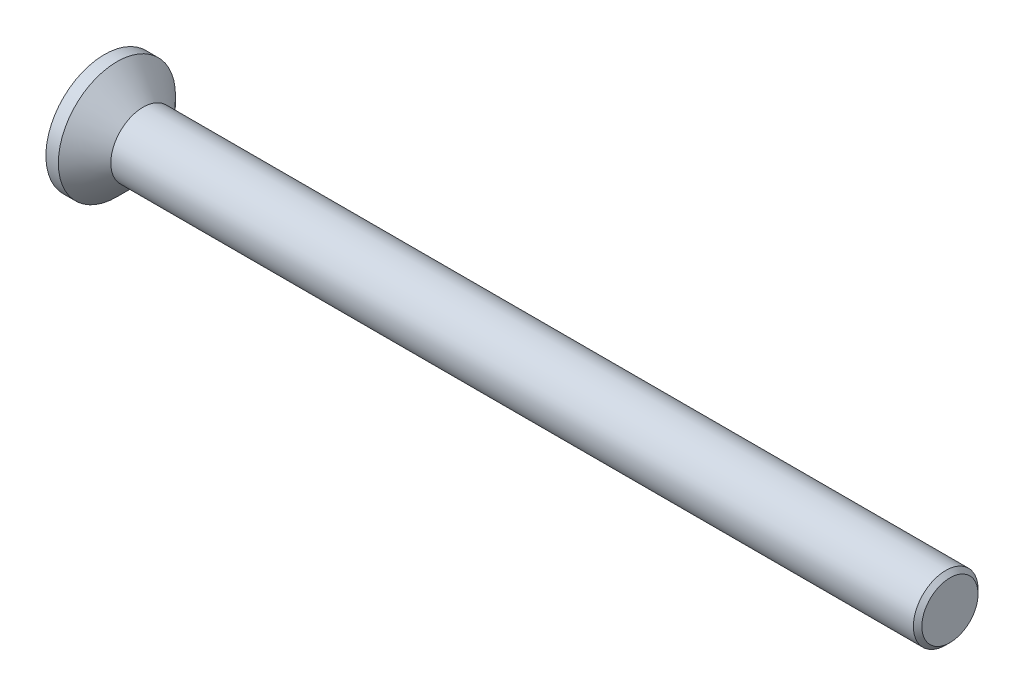
ISO-10303-21;
HEADER;
FILE_DESCRIPTION(('STEP AP214'),'2;1');
FILE_NAME('part.step','',(''),(''),'','','');
FILE_SCHEMA(('AUTOMOTIVE_DESIGN { 1 0 10303 214 1 1 1 1 }'));
ENDSEC;
DATA;
#1=APPLICATION_CONTEXT('core data for automotive mechanical design processes');
#2=APPLICATION_PROTOCOL_DEFINITION('international standard','automotive_design',2000,#1);
#3=PRODUCT_CONTEXT('',#1,'mechanical');
#4=PRODUCT('Part','Part','',(#3));
#5=PRODUCT_RELATED_PRODUCT_CATEGORY('part','',(#4));
#6=PRODUCT_DEFINITION_FORMATION('','',#4);
#7=PRODUCT_DEFINITION_CONTEXT('part definition',#1,'design');
#8=PRODUCT_DEFINITION('design','',#6,#7);
#9=PRODUCT_DEFINITION_SHAPE('','',#8);
#10=(LENGTH_UNIT() NAMED_UNIT(*) SI_UNIT(.MILLI.,.METRE.));
#11=(NAMED_UNIT(*) PLANE_ANGLE_UNIT() SI_UNIT($,.RADIAN.));
#12=(NAMED_UNIT(*) SI_UNIT($,.STERADIAN.) SOLID_ANGLE_UNIT());
#13=UNCERTAINTY_MEASURE_WITH_UNIT(LENGTH_MEASURE(1.E-05),#10,'distance_accuracy_value','');
#14=(GEOMETRIC_REPRESENTATION_CONTEXT(3) GLOBAL_UNCERTAINTY_ASSIGNED_CONTEXT((#13)) GLOBAL_UNIT_ASSIGNED_CONTEXT((#10,
#11,#12)) REPRESENTATION_CONTEXT('',''));
#15=CARTESIAN_POINT('',(0.,0.,0.));
#16=DIRECTION('',(0.,0.,1.));
#17=DIRECTION('',(1.,0.,0.));
#18=AXIS2_PLACEMENT_3D('',#15,#16,#17);
#19=CARTESIAN_POINT('',(1.09999999999999,0.,0.));
#20=DIRECTION('',(-1.,0.,0.));
#21=DIRECTION('',(0.,0.,1.));
#22=AXIS2_PLACEMENT_3D('',#19,#20,#21);
#23=CONICAL_SURFACE('',#22,0.99999999999989,1.04719755119658);
#24=CARTESIAN_POINT('',(1.67735026918958,0.,0.));
#25=VERTEX_POINT('',#24);
#26=VERTEX_LOOP('',#25);
#27=FACE_BOUND('',#26,.T.);
#28=CARTESIAN_POINT('',(1.09999999999999,0.,0.));
#29=DIRECTION('',(-1.,0.,0.));
#30=DIRECTION('',(0.,0.,1.));
#31=AXIS2_PLACEMENT_3D('',#28,#29,#30);
#32=CIRCLE('',#31,0.99999999999989);
#33=CARTESIAN_POINT('',(1.09999999999999,-0.499999999999972,0.86602540378439));
#34=VERTEX_POINT('',#33);
#35=CARTESIAN_POINT('',(1.09999999999999,0.499999999999972,0.866025403784391));
#36=VERTEX_POINT('',#35);
#37=EDGE_CURVE('E92',#34,#36,#32,.T.);
#38=ORIENTED_EDGE('',*,*,#37,.T.);
#39=CARTESIAN_POINT('',(1.09999999999999,0.,0.));
#40=DIRECTION('',(-1.,0.,0.));
#41=DIRECTION('',(0.,0.,1.));
#42=AXIS2_PLACEMENT_3D('',#39,#40,#41);
#43=CIRCLE('',#42,0.99999999999989);
#44=CARTESIAN_POINT('',(1.09999999999999,0.999999999999945,0.));
#45=VERTEX_POINT('',#44);
#46=EDGE_CURVE('E106',#36,#45,#43,.T.);
#47=ORIENTED_EDGE('',*,*,#46,.T.);
#48=CARTESIAN_POINT('',(1.09999999999999,0.,0.));
#49=DIRECTION('',(-1.,0.,0.));
#50=DIRECTION('',(0.,0.,1.));
#51=AXIS2_PLACEMENT_3D('',#48,#49,#50);
#52=CIRCLE('',#51,0.99999999999989);
#53=CARTESIAN_POINT('',(1.09999999999999,0.499999999999972,-0.866025403784391));
#54=VERTEX_POINT('',#53);
#55=EDGE_CURVE('E149',#45,#54,#52,.T.);
#56=ORIENTED_EDGE('',*,*,#55,.T.);
#57=CARTESIAN_POINT('',(1.09999999999999,0.,0.));
#58=DIRECTION('',(-1.,0.,0.));
#59=DIRECTION('',(0.,0.,1.));
#60=AXIS2_PLACEMENT_3D('',#57,#58,#59);
#61=CIRCLE('',#60,0.99999999999989);
#62=CARTESIAN_POINT('',(1.09999999999999,-0.499999999999973,-0.866025403784392));
#63=VERTEX_POINT('',#62);
#64=EDGE_CURVE('E136',#54,#63,#61,.T.);
#65=ORIENTED_EDGE('',*,*,#64,.T.);
#66=CARTESIAN_POINT('',(1.09999999999999,0.,0.));
#67=DIRECTION('',(-1.,0.,0.));
#68=DIRECTION('',(0.,0.,1.));
#69=AXIS2_PLACEMENT_3D('',#66,#67,#68);
#70=CIRCLE('',#69,0.99999999999989);
#71=CARTESIAN_POINT('',(1.09999999999999,-0.999999999999945,0.));
#72=VERTEX_POINT('',#71);
#73=EDGE_CURVE('E89',#63,#72,#70,.T.);
#74=ORIENTED_EDGE('',*,*,#73,.T.);
#75=CARTESIAN_POINT('',(1.09999999999999,0.,0.));
#76=DIRECTION('',(-1.,0.,0.));
#77=DIRECTION('',(0.,0.,1.));
#78=AXIS2_PLACEMENT_3D('',#75,#76,#77);
#79=CIRCLE('',#78,0.99999999999989);
#80=EDGE_CURVE('E20',#72,#34,#79,.T.);
#81=ORIENTED_EDGE('',*,*,#80,.T.);
#82=EDGE_LOOP('',(#38,#47,#56,#65,#74,#81));
#83=FACE_BOUND('',#82,.T.);
#84=ADVANCED_FACE('F17',(#27,#83),#23,.F.);
#85=CARTESIAN_POINT('',(1.1,0.,-1.15470053837925));
#86=DIRECTION('',(1.,0.,0.));
#87=DIRECTION('',(0.,0.,-1.));
#88=AXIS2_PLACEMENT_3D('',#85,#86,#87);
#89=PLANE('',#88);
#90=DIRECTION('',(0.,0.,1.));
#91=VECTOR('',#90,1.);
#92=CARTESIAN_POINT('',(1.1,-1.,0.577350269189625));
#93=LINE('',#92,#91);
#94=CARTESIAN_POINT('',(1.1,-1.,0.577350269189624));
#95=VERTEX_POINT('',#94);
#96=EDGE_CURVE('E111',#95,#72,#93,.F.);
#97=ORIENTED_EDGE('',*,*,#96,.F.);
#98=DIRECTION('',(0.,0.866025403784439,0.5));
#99=VECTOR('',#98,1.);
#100=CARTESIAN_POINT('',(1.1,0.,1.15470053837925));
#101=LINE('',#100,#99);
#102=EDGE_CURVE('E108',#34,#95,#101,.F.);
#103=ORIENTED_EDGE('',*,*,#102,.F.);
#104=ORIENTED_EDGE('',*,*,#80,.F.);
#105=EDGE_LOOP('',(#97,#103,#104));
#106=FACE_BOUND('',#105,.T.);
#107=ADVANCED_FACE('F109',(#106),#89,.F.);
#108=CARTESIAN_POINT('',(1.1,0.,-1.15470053837925));
#109=DIRECTION('',(1.,0.,0.));
#110=DIRECTION('',(0.,0.,-1.));
#111=AXIS2_PLACEMENT_3D('',#108,#109,#110);
#112=PLANE('',#111);
#113=DIRECTION('',(0.,0.866025403784439,0.5));
#114=VECTOR('',#113,1.);
#115=CARTESIAN_POINT('',(1.1,0.,1.15470053837925));
#116=LINE('',#115,#114);
#117=CARTESIAN_POINT('',(1.1,0.,1.15470053837925));
#118=VERTEX_POINT('',#117);
#119=EDGE_CURVE('E101',#118,#34,#116,.F.);
#120=ORIENTED_EDGE('',*,*,#119,.F.);
#121=DIRECTION('',(0.,0.866025403784439,-0.5));
#122=VECTOR('',#121,1.);
#123=CARTESIAN_POINT('',(1.1,1.,0.577350269189625));
#124=LINE('',#123,#122);
#125=EDGE_CURVE('E104',#36,#118,#124,.F.);
#126=ORIENTED_EDGE('',*,*,#125,.F.);
#127=ORIENTED_EDGE('',*,*,#37,.F.);
#128=EDGE_LOOP('',(#120,#126,#127));
#129=FACE_BOUND('',#128,.T.);
#130=ADVANCED_FACE('F99',(#129),#112,.F.);
#131=CARTESIAN_POINT('',(1.1,0.,-1.15470053837925));
#132=DIRECTION('',(1.,0.,0.));
#133=DIRECTION('',(0.,0.,-1.));
#134=AXIS2_PLACEMENT_3D('',#131,#132,#133);
#135=PLANE('',#134);
#136=DIRECTION('',(0.,0.866025403784439,-0.5));
#137=VECTOR('',#136,1.);
#138=CARTESIAN_POINT('',(1.1,1.,0.577350269189625));
#139=LINE('',#138,#137);
#140=CARTESIAN_POINT('',(1.1,1.,0.577350269189625));
#141=VERTEX_POINT('',#140);
#142=EDGE_CURVE('E132',#141,#36,#139,.F.);
#143=ORIENTED_EDGE('',*,*,#142,.F.);
#144=DIRECTION('',(0.,0.,-1.));
#145=VECTOR('',#144,1.);
#146=CARTESIAN_POINT('',(1.1,1.,-0.577350269189625));
#147=LINE('',#146,#145);
#148=EDGE_CURVE('E165',#45,#141,#147,.F.);
#149=ORIENTED_EDGE('',*,*,#148,.F.);
#150=ORIENTED_EDGE('',*,*,#46,.F.);
#151=EDGE_LOOP('',(#143,#149,#150));
#152=FACE_BOUND('',#151,.T.);
#153=ADVANCED_FACE('F166',(#152),#135,.F.);
#154=CARTESIAN_POINT('',(1.1,0.,-1.15470053837925));
#155=DIRECTION('',(1.,0.,0.));
#156=DIRECTION('',(0.,0.,-1.));
#157=AXIS2_PLACEMENT_3D('',#154,#155,#156);
#158=PLANE('',#157);
#159=DIRECTION('',(0.,0.,-1.));
#160=VECTOR('',#159,1.);
#161=CARTESIAN_POINT('',(1.1,1.,-0.577350269189625));
#162=LINE('',#161,#160);
#163=CARTESIAN_POINT('',(1.1,1.,-0.577350269189625));
#164=VERTEX_POINT('',#163);
#165=EDGE_CURVE('E159',#164,#45,#162,.F.);
#166=ORIENTED_EDGE('',*,*,#165,.F.);
#167=DIRECTION('',(0.,-0.866025403784439,-0.5));
#168=VECTOR('',#167,1.);
#169=CARTESIAN_POINT('',(1.1,0.,-1.15470053837925));
#170=LINE('',#169,#168);
#171=EDGE_CURVE('E162',#54,#164,#170,.F.);
#172=ORIENTED_EDGE('',*,*,#171,.F.);
#173=ORIENTED_EDGE('',*,*,#55,.F.);
#174=EDGE_LOOP('',(#166,#172,#173));
#175=FACE_BOUND('',#174,.T.);
#176=ADVANCED_FACE('F157',(#175),#158,.F.);
#177=CARTESIAN_POINT('',(1.1,0.,-1.15470053837925));
#178=DIRECTION('',(1.,0.,0.));
#179=DIRECTION('',(0.,0.,-1.));
#180=AXIS2_PLACEMENT_3D('',#177,#178,#179);
#181=PLANE('',#180);
#182=DIRECTION('',(0.,-0.866025403784439,0.5));
#183=VECTOR('',#182,1.);
#184=CARTESIAN_POINT('',(1.1,-1.,-0.577350269189628));
#185=LINE('',#184,#183);
#186=CARTESIAN_POINT('',(1.1,-1.,-0.577350269189628));
#187=VERTEX_POINT('',#186);
#188=EDGE_CURVE('E211',#187,#63,#185,.F.);
#189=ORIENTED_EDGE('',*,*,#188,.F.);
#190=DIRECTION('',(0.,0.,1.));
#191=VECTOR('',#190,1.);
#192=CARTESIAN_POINT('',(1.1,-1.,0.577350269189625));
#193=LINE('',#192,#191);
#194=EDGE_CURVE('E120',#72,#187,#193,.F.);
#195=ORIENTED_EDGE('',*,*,#194,.F.);
#196=ORIENTED_EDGE('',*,*,#73,.F.);
#197=EDGE_LOOP('',(#189,#195,#196));
#198=FACE_BOUND('',#197,.T.);
#199=ADVANCED_FACE('F250',(#198),#181,.F.);
#200=CARTESIAN_POINT('',(1.1,0.,-1.15470053837925));
#201=DIRECTION('',(1.,0.,0.));
#202=DIRECTION('',(0.,0.,-1.));
#203=AXIS2_PLACEMENT_3D('',#200,#201,#202);
#204=PLANE('',#203);
#205=DIRECTION('',(0.,-0.866025403784439,-0.5));
#206=VECTOR('',#205,1.);
#207=CARTESIAN_POINT('',(1.1,0.,-1.15470053837925));
#208=LINE('',#207,#206);
#209=CARTESIAN_POINT('',(1.1,0.,-1.15470053837925));
#210=VERTEX_POINT('',#209);
#211=EDGE_CURVE('E184',#210,#54,#208,.F.);
#212=ORIENTED_EDGE('',*,*,#211,.F.);
#213=DIRECTION('',(0.,-0.866025403784439,0.5));
#214=VECTOR('',#213,1.);
#215=CARTESIAN_POINT('',(1.1,-1.,-0.577350269189628));
#216=LINE('',#215,#214);
#217=EDGE_CURVE('E214',#63,#210,#216,.F.);
#218=ORIENTED_EDGE('',*,*,#217,.F.);
#219=ORIENTED_EDGE('',*,*,#64,.F.);
#220=EDGE_LOOP('',(#212,#218,#219));
#221=FACE_BOUND('',#220,.T.);
#222=ADVANCED_FACE('F247',(#221),#204,.F.);
#223=CARTESIAN_POINT('',(1.1,-1.,0.577350269189625));
#224=DIRECTION('',(0.,1.,0.));
#225=DIRECTION('',(0.,0.,1.));
#226=AXIS2_PLACEMENT_3D('',#223,#224,#225);
#227=PLANE('',#226);
#228=ORIENTED_EDGE('',*,*,#194,.T.);
#229=DIRECTION('',(1.,0.,0.));
#230=VECTOR('',#229,1.);
#231=CARTESIAN_POINT('',(1.1,-1.,-0.577350269189628));
#232=LINE('',#231,#230);
#233=CARTESIAN_POINT('',(0.,-1.,-0.577350269189628));
#234=VERTEX_POINT('',#233);
#235=EDGE_CURVE('E215',#234,#187,#232,.T.);
#236=ORIENTED_EDGE('',*,*,#235,.F.);
#237=DIRECTION('',(0.,0.,-1.));
#238=VECTOR('',#237,1.);
#239=CARTESIAN_POINT('',(0.,-1.,0.));
#240=LINE('',#239,#238);
#241=CARTESIAN_POINT('',(0.,-1.,0.577350269189625));
#242=VERTEX_POINT('',#241);
#243=EDGE_CURVE('E210',#234,#242,#240,.F.);
#244=ORIENTED_EDGE('',*,*,#243,.T.);
#245=DIRECTION('',(1.,0.,0.));
#246=VECTOR('',#245,1.);
#247=CARTESIAN_POINT('',(1.1,-1.,0.577350269189624));
#248=LINE('',#247,#246);
#249=EDGE_CURVE('E115',#95,#242,#248,.F.);
#250=ORIENTED_EDGE('',*,*,#249,.F.);
#251=ORIENTED_EDGE('',*,*,#96,.T.);
#252=EDGE_LOOP('',(#228,#236,#244,#250,#251));
#253=FACE_BOUND('',#252,.T.);
#254=ADVANCED_FACE('F252',(#253),#227,.T.);
#255=CARTESIAN_POINT('',(1.1,0.,1.15470053837925));
#256=DIRECTION('',(0.,0.5,-0.866025403784439));
#257=DIRECTION('',(0.,0.866025403784439,0.5));
#258=AXIS2_PLACEMENT_3D('',#255,#256,#257);
#259=PLANE('',#258);
#260=ORIENTED_EDGE('',*,*,#102,.T.);
#261=ORIENTED_EDGE('',*,*,#249,.T.);
#262=DIRECTION('',(0.,0.866025403784439,0.499999999999999));
#263=VECTOR('',#262,1.);
#264=CARTESIAN_POINT('',(0.,-1.,0.577350269189625));
#265=LINE('',#264,#263);
#266=CARTESIAN_POINT('',(0.,0.,1.15470053837925));
#267=VERTEX_POINT('',#266);
#268=EDGE_CURVE('E205',#242,#267,#265,.T.);
#269=ORIENTED_EDGE('',*,*,#268,.T.);
#270=DIRECTION('',(1.,0.,0.));
#271=VECTOR('',#270,1.);
#272=CARTESIAN_POINT('',(1.1,0.,1.15470053837925));
#273=LINE('',#272,#271);
#274=EDGE_CURVE('E119',#118,#267,#273,.F.);
#275=ORIENTED_EDGE('',*,*,#274,.F.);
#276=ORIENTED_EDGE('',*,*,#119,.T.);
#277=EDGE_LOOP('',(#260,#261,#269,#275,#276));
#278=FACE_BOUND('',#277,.T.);
#279=ADVANCED_FACE('F117',(#278),#259,.T.);
#280=CARTESIAN_POINT('',(1.1,1.,0.577350269189625));
#281=DIRECTION('',(0.,-0.5,-0.866025403784439));
#282=DIRECTION('',(0.,0.866025403784439,-0.5));
#283=AXIS2_PLACEMENT_3D('',#280,#281,#282);
#284=PLANE('',#283);
#285=ORIENTED_EDGE('',*,*,#125,.T.);
#286=ORIENTED_EDGE('',*,*,#274,.T.);
#287=DIRECTION('',(0.,0.866025403784439,-0.5));
#288=VECTOR('',#287,1.);
#289=CARTESIAN_POINT('',(0.,0.,1.15470053837925));
#290=LINE('',#289,#288);
#291=CARTESIAN_POINT('',(0.,1.,0.577350269189625));
#292=VERTEX_POINT('',#291);
#293=EDGE_CURVE('E195',#267,#292,#290,.T.);
#294=ORIENTED_EDGE('',*,*,#293,.T.);
#295=DIRECTION('',(1.,0.,0.));
#296=VECTOR('',#295,1.);
#297=CARTESIAN_POINT('',(1.1,1.,0.577350269189625));
#298=LINE('',#297,#296);
#299=EDGE_CURVE('E170',#141,#292,#298,.F.);
#300=ORIENTED_EDGE('',*,*,#299,.F.);
#301=ORIENTED_EDGE('',*,*,#142,.T.);
#302=EDGE_LOOP('',(#285,#286,#294,#300,#301));
#303=FACE_BOUND('',#302,.T.);
#304=ADVANCED_FACE('F193',(#303),#284,.T.);
#305=CARTESIAN_POINT('',(1.1,1.,-0.577350269189625));
#306=DIRECTION('',(0.,-1.,0.));
#307=DIRECTION('',(0.,0.,-1.));
#308=AXIS2_PLACEMENT_3D('',#305,#306,#307);
#309=PLANE('',#308);
#310=ORIENTED_EDGE('',*,*,#148,.T.);
#311=ORIENTED_EDGE('',*,*,#299,.T.);
#312=DIRECTION('',(0.,0.,-1.));
#313=VECTOR('',#312,1.);
#314=CARTESIAN_POINT('',(0.,1.,0.));
#315=LINE('',#314,#313);
#316=CARTESIAN_POINT('',(0.,1.,-0.577350269189625));
#317=VERTEX_POINT('',#316);
#318=EDGE_CURVE('E197',#292,#317,#315,.T.);
#319=ORIENTED_EDGE('',*,*,#318,.T.);
#320=DIRECTION('',(1.,0.,0.));
#321=VECTOR('',#320,1.);
#322=CARTESIAN_POINT('',(1.1,1.,-0.577350269189626));
#323=LINE('',#322,#321);
#324=EDGE_CURVE('E173',#164,#317,#323,.F.);
#325=ORIENTED_EDGE('',*,*,#324,.F.);
#326=ORIENTED_EDGE('',*,*,#165,.T.);
#327=EDGE_LOOP('',(#310,#311,#319,#325,#326));
#328=FACE_BOUND('',#327,.T.);
#329=ADVANCED_FACE('F172',(#328),#309,.T.);
#330=CARTESIAN_POINT('',(1.1,0.,-1.15470053837925));
#331=DIRECTION('',(0.,-0.5,0.866025403784439));
#332=DIRECTION('',(0.,-0.866025403784439,-0.5));
#333=AXIS2_PLACEMENT_3D('',#330,#331,#332);
#334=PLANE('',#333);
#335=ORIENTED_EDGE('',*,*,#171,.T.);
#336=ORIENTED_EDGE('',*,*,#324,.T.);
#337=DIRECTION('',(0.,-0.866025403784438,-0.5));
#338=VECTOR('',#337,1.);
#339=CARTESIAN_POINT('',(0.,1.,-0.577350269189625));
#340=LINE('',#339,#338);
#341=CARTESIAN_POINT('',(0.,0.,-1.15470053837925));
#342=VERTEX_POINT('',#341);
#343=EDGE_CURVE('E35',#317,#342,#340,.T.);
#344=ORIENTED_EDGE('',*,*,#343,.T.);
#345=DIRECTION('',(1.,0.,0.));
#346=VECTOR('',#345,1.);
#347=CARTESIAN_POINT('',(1.1,0.,-1.15470053837925));
#348=LINE('',#347,#346);
#349=EDGE_CURVE('E220',#210,#342,#348,.F.);
#350=ORIENTED_EDGE('',*,*,#349,.F.);
#351=ORIENTED_EDGE('',*,*,#211,.T.);
#352=EDGE_LOOP('',(#335,#336,#344,#350,#351));
#353=FACE_BOUND('',#352,.T.);
#354=ADVANCED_FACE('F244',(#353),#334,.T.);
#355=CARTESIAN_POINT('',(1.1,-1.,-0.577350269189628));
#356=DIRECTION('',(0.,0.5,0.866025403784439));
#357=DIRECTION('',(0.,-0.866025403784439,0.5));
#358=AXIS2_PLACEMENT_3D('',#355,#356,#357);
#359=PLANE('',#358);
#360=ORIENTED_EDGE('',*,*,#217,.T.);
#361=ORIENTED_EDGE('',*,*,#349,.T.);
#362=DIRECTION('',(0.,-0.866025403784439,0.5));
#363=VECTOR('',#362,1.);
#364=CARTESIAN_POINT('',(0.,0.,-1.15470053837925));
#365=LINE('',#364,#363);
#366=EDGE_CURVE('E146',#342,#234,#365,.T.);
#367=ORIENTED_EDGE('',*,*,#366,.T.);
#368=ORIENTED_EDGE('',*,*,#235,.T.);
#369=ORIENTED_EDGE('',*,*,#188,.T.);
#370=EDGE_LOOP('',(#360,#361,#367,#368,#369));
#371=FACE_BOUND('',#370,.T.);
#372=ADVANCED_FACE('F255',(#371),#359,.T.);
#373=CARTESIAN_POINT('',(0.,0.,0.));
#374=DIRECTION('',(1.,0.,0.));
#375=DIRECTION('',(0.,0.,-1.));
#376=AXIS2_PLACEMENT_3D('',#373,#374,#375);
#377=PLANE('',#376);
#378=ORIENTED_EDGE('',*,*,#343,.F.);
#379=ORIENTED_EDGE('',*,*,#318,.F.);
#380=ORIENTED_EDGE('',*,*,#293,.F.);
#381=ORIENTED_EDGE('',*,*,#268,.F.);
#382=ORIENTED_EDGE('',*,*,#243,.F.);
#383=ORIENTED_EDGE('',*,*,#366,.F.);
#384=EDGE_LOOP('',(#378,#379,#380,#381,#382,#383));
#385=FACE_BOUND('',#384,.T.);
#386=CARTESIAN_POINT('',(0.,0.,0.));
#387=DIRECTION('',(1.,0.,0.));
#388=DIRECTION('',(0.,0.,-1.));
#389=AXIS2_PLACEMENT_3D('',#386,#387,#388);
#390=CIRCLE('',#389,2.77);
#391=CARTESIAN_POINT('',(0.,0.,-2.77));
#392=VERTEX_POINT('',#391);
#393=EDGE_CURVE('E143',#392,#392,#390,.T.);
#394=ORIENTED_EDGE('',*,*,#393,.F.);
#395=EDGE_LOOP('',(#394));
#396=FACE_BOUND('',#395,.T.);
#397=ADVANCED_FACE('F199',(#385,#396),#377,.F.);
#398=CARTESIAN_POINT('',(40.0007106781187,0.,0.));
#399=DIRECTION('',(-1.,0.,0.));
#400=DIRECTION('',(0.,0.,1.));
#401=AXIS2_PLACEMENT_3D('',#398,#399,#400);
#402=PLANE('',#401);
#403=CARTESIAN_POINT('',(40.0007106781004,0.,0.));
#404=DIRECTION('',(-1.,0.,0.));
#405=DIRECTION('',(0.,0.,1.));
#406=AXIS2_PLACEMENT_3D('',#403,#404,#405);
#407=CIRCLE('',#406,1.32928932180221);
#408=CARTESIAN_POINT('',(40.0007106781004,0.,1.32928932180221));
#409=VERTEX_POINT('',#408);
#410=EDGE_CURVE('E139',#409,#409,#407,.T.);
#411=ORIENTED_EDGE('',*,*,#410,.F.);
#412=EDGE_LOOP('',(#411));
#413=FACE_BOUND('',#412,.T.);
#414=ADVANCED_FACE('F263',(#413),#402,.F.);
#415=CARTESIAN_POINT('',(11.8531386861314,0.,0.));
#416=DIRECTION('',(1.,0.,0.));
#417=DIRECTION('',(0.,0.,-1.));
#418=AXIS2_PLACEMENT_3D('',#415,#416,#417);
#419=CYLINDRICAL_SURFACE('',#418,2.77);
#420=CARTESIAN_POINT('',(0.589999999988322,0.,0.));
#421=DIRECTION('',(-1.,0.,0.));
#422=DIRECTION('',(0.,0.,-1.));
#423=AXIS2_PLACEMENT_3D('',#420,#421,#422);
#424=CIRCLE('',#423,2.77000000005501);
#425=CARTESIAN_POINT('',(0.589999999988322,0.,-2.77000000005501));
#426=VERTEX_POINT('',#425);
#427=EDGE_CURVE('E142',#426,#426,#424,.F.);
#428=ORIENTED_EDGE('',*,*,#427,.F.);
#429=EDGE_LOOP('',(#428));
#430=FACE_BOUND('',#429,.T.);
#431=ORIENTED_EDGE('',*,*,#393,.T.);
#432=EDGE_LOOP('',(#431));
#433=FACE_BOUND('',#432,.T.);
#434=ADVANCED_FACE('F281',(#430,#433),#419,.T.);
#435=CARTESIAN_POINT('',(39.8007106781506,0.,0.));
#436=DIRECTION('',(-1.,0.,0.));
#437=DIRECTION('',(0.,0.,1.));
#438=AXIS2_PLACEMENT_3D('',#435,#436,#437);
#439=CONICAL_SURFACE('',#438,1.52928932180885,0.785398163539557);
#440=CARTESIAN_POINT('',(39.8007106781186,0.,0.));
#441=DIRECTION('',(-1.,0.,0.));
#442=DIRECTION('',(0.,0.,1.));
#443=AXIS2_PLACEMENT_3D('',#440,#441,#442);
#444=CIRCLE('',#443,1.52928932188135);
#445=CARTESIAN_POINT('',(39.8007106781186,0.,1.52928932188135));
#446=VERTEX_POINT('',#445);
#447=EDGE_CURVE('E26',#446,#446,#444,.T.);
#448=ORIENTED_EDGE('',*,*,#447,.F.);
#449=EDGE_LOOP('',(#448));
#450=FACE_BOUND('',#449,.T.);
#451=ORIENTED_EDGE('',*,*,#410,.T.);
#452=EDGE_LOOP('',(#451));
#453=FACE_BOUND('',#452,.T.);
#454=ADVANCED_FACE('F274',(#450,#453),#439,.T.);
#455=CARTESIAN_POINT('',(0.589999999931479,0.,0.));
#456=DIRECTION('',(-1.,0.,0.));
#457=DIRECTION('',(0.,0.,1.));
#458=AXIS2_PLACEMENT_3D('',#455,#456,#457);
#459=CONICAL_SURFACE('',#458,2.77000000011185,0.785398163397448);
#460=ORIENTED_EDGE('',*,*,#427,.T.);
#461=EDGE_LOOP('',(#460));
#462=FACE_BOUND('',#461,.T.);
#463=CARTESIAN_POINT('',(1.83071067811866,0.,0.));
#464=DIRECTION('',(-1.,0.,0.));
#465=DIRECTION('',(0.,0.,1.));
#466=AXIS2_PLACEMENT_3D('',#463,#464,#465);
#467=CIRCLE('',#466,1.52928932188135);
#468=CARTESIAN_POINT('',(1.83071067811866,0.,1.52928932188135));
#469=VERTEX_POINT('',#468);
#470=EDGE_CURVE('E11',#469,#469,#467,.F.);
#471=ORIENTED_EDGE('',*,*,#470,.F.);
#472=EDGE_LOOP('',(#471));
#473=FACE_BOUND('',#472,.T.);
#474=ADVANCED_FACE('F268',(#462,#473),#459,.T.);
#475=CARTESIAN_POINT('',(10.0007106781187,0.,0.));
#476=DIRECTION('',(-1.,0.,0.));
#477=DIRECTION('',(0.,0.,1.));
#478=AXIS2_PLACEMENT_3D('',#475,#476,#477);
#479=CYLINDRICAL_SURFACE('',#478,1.52928932188135);
#480=ORIENTED_EDGE('',*,*,#470,.T.);
#481=EDGE_LOOP('',(#480));
#482=FACE_BOUND('',#481,.T.);
#483=ORIENTED_EDGE('',*,*,#447,.T.);
#484=EDGE_LOOP('',(#483));
#485=FACE_BOUND('',#484,.T.);
#486=ADVANCED_FACE('F266',(#482,#485),#479,.T.);
#487=CLOSED_SHELL('',(#84,#107,#130,#153,#176,#199,#222,#254,#279,#304,#329,#354,#372,#397,#414,
#434,#454,#474,#486));
#488=MANIFOLD_SOLID_BREP('B1',#487);
#489=ADVANCED_BREP_SHAPE_REPRESENTATION('',(#18,#488),#14);
#490=SHAPE_DEFINITION_REPRESENTATION(#9,#489);
ENDSEC;
END-ISO-10303-21;
